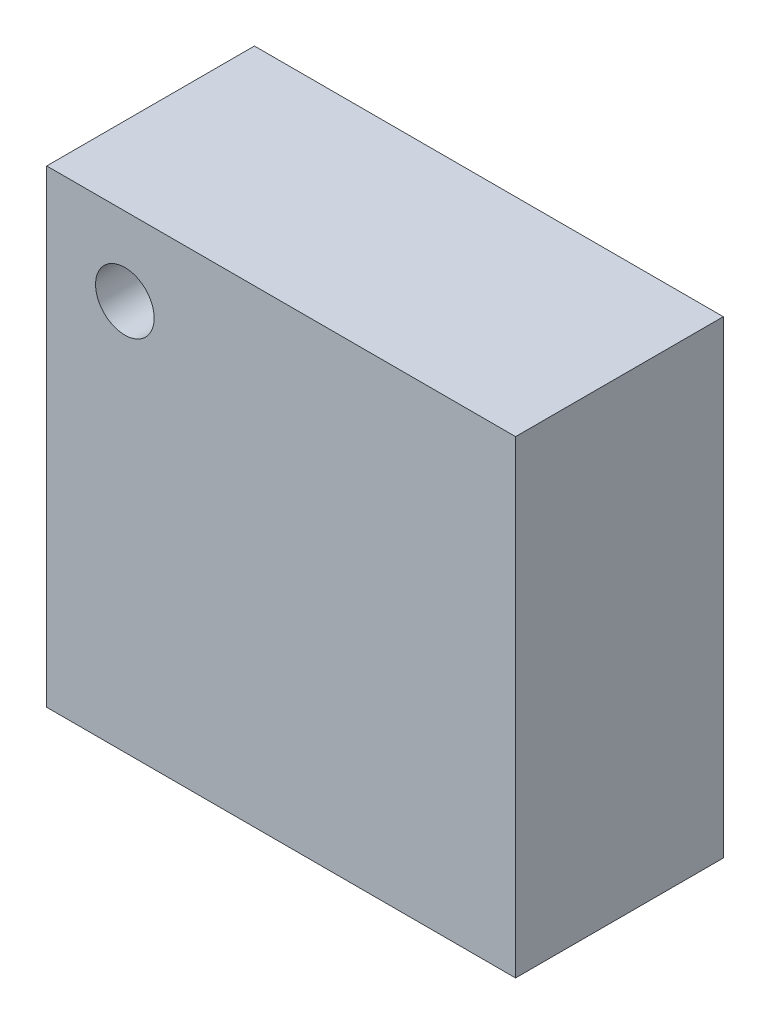
ISO-10303-21;
HEADER;
FILE_DESCRIPTION(('STEP AP214'),'2;1');
FILE_NAME('part.step','',(''),(''),'','','');
FILE_SCHEMA(('AUTOMOTIVE_DESIGN { 1 0 10303 214 1 1 1 1 }'));
ENDSEC;
DATA;
#1=APPLICATION_CONTEXT('core data for automotive mechanical design processes');
#2=APPLICATION_PROTOCOL_DEFINITION('international standard','automotive_design',2000,#1);
#3=PRODUCT_CONTEXT('',#1,'mechanical');
#4=PRODUCT('Part','Part','',(#3));
#5=PRODUCT_RELATED_PRODUCT_CATEGORY('part','',(#4));
#6=PRODUCT_DEFINITION_FORMATION('','',#4);
#7=PRODUCT_DEFINITION_CONTEXT('part definition',#1,'design');
#8=PRODUCT_DEFINITION('design','',#6,#7);
#9=PRODUCT_DEFINITION_SHAPE('','',#8);
#10=(LENGTH_UNIT() NAMED_UNIT(*) SI_UNIT(.MILLI.,.METRE.));
#11=(NAMED_UNIT(*) PLANE_ANGLE_UNIT() SI_UNIT($,.RADIAN.));
#12=(NAMED_UNIT(*) SI_UNIT($,.STERADIAN.) SOLID_ANGLE_UNIT());
#13=UNCERTAINTY_MEASURE_WITH_UNIT(LENGTH_MEASURE(1.E-05),#10,'distance_accuracy_value','');
#14=(GEOMETRIC_REPRESENTATION_CONTEXT(3) GLOBAL_UNCERTAINTY_ASSIGNED_CONTEXT((#13)) GLOBAL_UNIT_ASSIGNED_CONTEXT((#10,
#11,#12)) REPRESENTATION_CONTEXT('',''));
#15=CARTESIAN_POINT('',(0.,0.,0.));
#16=DIRECTION('',(0.,0.,1.));
#17=DIRECTION('',(1.,0.,0.));
#18=AXIS2_PLACEMENT_3D('',#15,#16,#17);
#19=CARTESIAN_POINT('',(0.131666666667,0.658333333333,0.45));
#20=DIRECTION('',(0.,0.,1.));
#21=DIRECTION('',(1.,0.,0.));
#22=AXIS2_PLACEMENT_3D('',#19,#20,#21);
#23=PLANE('',#22);
#24=CARTESIAN_POINT('',(0.131666666667,0.658333333333,0.45));
#25=DIRECTION('',(0.,0.,1.));
#26=DIRECTION('',(1.,0.,0.));
#27=AXIS2_PLACEMENT_3D('',#24,#25,#26);
#28=CIRCLE('',#27,0.049375);
#29=CARTESIAN_POINT('',(0.082291666667,0.658333333333,0.45));
#30=VERTEX_POINT('',#29);
#31=EDGE_CURVE('E27',#30,#30,#28,.T.);
#32=ORIENTED_EDGE('',*,*,#31,.T.);
#33=EDGE_LOOP('',(#32));
#34=FACE_BOUND('',#33,.T.);
#35=ADVANCED_FACE('F16',(#34),#23,.T.);
#36=CARTESIAN_POINT('',(0.131666666667,0.658333333333,0.45));
#37=DIRECTION('',(0.,0.,1.));
#38=DIRECTION('',(1.,0.,0.));
#39=AXIS2_PLACEMENT_3D('',#36,#37,#38);
#40=CYLINDRICAL_SURFACE('',#39,0.049375);
#41=ORIENTED_EDGE('',*,*,#31,.F.);
#42=DIRECTION('',(0.,0.,1.));
#43=VECTOR('',#42,1.);
#44=CARTESIAN_POINT('',(0.082291666667,0.658333333333,0.45));
#45=LINE('',#44,#43);
#46=CARTESIAN_POINT('',(0.082291666667,0.658333333333,0.55));
#47=VERTEX_POINT('',#46);
#48=EDGE_CURVE('E11',#30,#47,#45,.T.);
#49=ORIENTED_EDGE('',*,*,#48,.T.);
#50=CARTESIAN_POINT('',(0.131666666667,0.658333333333,0.55));
#51=DIRECTION('',(0.,0.,1.));
#52=DIRECTION('',(1.,0.,0.));
#53=AXIS2_PLACEMENT_3D('',#50,#51,#52);
#54=CIRCLE('',#53,0.049375);
#55=EDGE_CURVE('E97',#47,#47,#54,.T.);
#56=ORIENTED_EDGE('',*,*,#55,.T.);
#57=ORIENTED_EDGE('',*,*,#48,.F.);
#58=EDGE_LOOP('',(#41,#49,#56,#57));
#59=FACE_BOUND('',#58,.T.);
#60=ADVANCED_FACE('F149',(#59),#40,.F.);
#61=CARTESIAN_POINT('',(0.79,0.,0.2));
#62=DIRECTION('',(1.,0.,0.));
#63=DIRECTION('',(0.,1.,0.));
#64=AXIS2_PLACEMENT_3D('',#61,#62,#63);
#65=PLANE('',#64);
#66=DIRECTION('',(0.,0.,1.));
#67=VECTOR('',#66,1.);
#68=CARTESIAN_POINT('',(0.79,0.,0.2));
#69=LINE('',#68,#67);
#70=CARTESIAN_POINT('',(0.79,0.,0.2));
#71=VERTEX_POINT('',#70);
#72=CARTESIAN_POINT('',(0.79,0.,0.55));
#73=VERTEX_POINT('',#72);
#74=EDGE_CURVE('E127',#71,#73,#69,.T.);
#75=ORIENTED_EDGE('',*,*,#74,.F.);
#76=DIRECTION('',(0.,1.,0.));
#77=VECTOR('',#76,1.);
#78=CARTESIAN_POINT('',(0.79,0.,0.2));
#79=LINE('',#78,#77);
#80=CARTESIAN_POINT('',(0.79,0.79,0.2));
#81=VERTEX_POINT('',#80);
#82=EDGE_CURVE('E119',#71,#81,#79,.T.);
#83=ORIENTED_EDGE('',*,*,#82,.T.);
#84=DIRECTION('',(0.,0.,1.));
#85=VECTOR('',#84,1.);
#86=CARTESIAN_POINT('',(0.79,0.79,0.2));
#87=LINE('',#86,#85);
#88=CARTESIAN_POINT('',(0.79,0.79,0.55));
#89=VERTEX_POINT('',#88);
#90=EDGE_CURVE('E94',#81,#89,#87,.T.);
#91=ORIENTED_EDGE('',*,*,#90,.T.);
#92=DIRECTION('',(0.,1.,0.));
#93=VECTOR('',#92,1.);
#94=CARTESIAN_POINT('',(0.79,0.,0.55));
#95=LINE('',#94,#93);
#96=EDGE_CURVE('E125',#73,#89,#95,.T.);
#97=ORIENTED_EDGE('',*,*,#96,.F.);
#98=EDGE_LOOP('',(#75,#83,#91,#97));
#99=FACE_BOUND('',#98,.T.);
#100=ADVANCED_FACE('F133',(#99),#65,.T.);
#101=CARTESIAN_POINT('',(0.,0.,0.2));
#102=DIRECTION('',(0.,0.,1.));
#103=DIRECTION('',(1.,0.,0.));
#104=AXIS2_PLACEMENT_3D('',#101,#102,#103);
#105=PLANE('',#104);
#106=DIRECTION('',(0.,1.,0.));
#107=VECTOR('',#106,1.);
#108=CARTESIAN_POINT('',(0.,0.,0.2));
#109=LINE('',#108,#107);
#110=CARTESIAN_POINT('',(0.,0.,0.2));
#111=VERTEX_POINT('',#110);
#112=CARTESIAN_POINT('',(0.,0.79,0.2));
#113=VERTEX_POINT('',#112);
#114=EDGE_CURVE('E99',#111,#113,#109,.T.);
#115=ORIENTED_EDGE('',*,*,#114,.T.);
#116=DIRECTION('',(1.,0.,0.));
#117=VECTOR('',#116,1.);
#118=CARTESIAN_POINT('',(0.,0.79,0.2));
#119=LINE('',#118,#117);
#120=EDGE_CURVE('E20',#113,#81,#119,.T.);
#121=ORIENTED_EDGE('',*,*,#120,.T.);
#122=ORIENTED_EDGE('',*,*,#82,.F.);
#123=DIRECTION('',(1.,0.,0.));
#124=VECTOR('',#123,1.);
#125=CARTESIAN_POINT('',(0.,0.,0.2));
#126=LINE('',#125,#124);
#127=EDGE_CURVE('E102',#111,#71,#126,.T.);
#128=ORIENTED_EDGE('',*,*,#127,.F.);
#129=EDGE_LOOP('',(#115,#121,#122,#128));
#130=FACE_BOUND('',#129,.T.);
#131=ADVANCED_FACE('F100',(#130),#105,.F.);
#132=CARTESIAN_POINT('',(0.,0.79,0.2));
#133=DIRECTION('',(0.,1.,0.));
#134=DIRECTION('',(1.,0.,0.));
#135=AXIS2_PLACEMENT_3D('',#132,#133,#134);
#136=PLANE('',#135);
#137=ORIENTED_EDGE('',*,*,#120,.F.);
#138=DIRECTION('',(0.,0.,1.));
#139=VECTOR('',#138,1.);
#140=CARTESIAN_POINT('',(0.,0.79,0.2));
#141=LINE('',#140,#139);
#142=CARTESIAN_POINT('',(0.,0.79,0.55));
#143=VERTEX_POINT('',#142);
#144=EDGE_CURVE('E92',#113,#143,#141,.T.);
#145=ORIENTED_EDGE('',*,*,#144,.T.);
#146=DIRECTION('',(1.,0.,0.));
#147=VECTOR('',#146,1.);
#148=CARTESIAN_POINT('',(0.,0.79,0.55));
#149=LINE('',#148,#147);
#150=EDGE_CURVE('E81',#143,#89,#149,.T.);
#151=ORIENTED_EDGE('',*,*,#150,.T.);
#152=ORIENTED_EDGE('',*,*,#90,.F.);
#153=EDGE_LOOP('',(#137,#145,#151,#152));
#154=FACE_BOUND('',#153,.T.);
#155=ADVANCED_FACE('F90',(#154),#136,.T.);
#156=CARTESIAN_POINT('',(0.,0.,0.55));
#157=DIRECTION('',(0.,0.,1.));
#158=DIRECTION('',(1.,0.,0.));
#159=AXIS2_PLACEMENT_3D('',#156,#157,#158);
#160=PLANE('',#159);
#161=ORIENTED_EDGE('',*,*,#55,.F.);
#162=EDGE_LOOP('',(#161));
#163=FACE_BOUND('',#162,.T.);
#164=DIRECTION('',(0.,1.,0.));
#165=VECTOR('',#164,1.);
#166=CARTESIAN_POINT('',(0.,0.,0.55));
#167=LINE('',#166,#165);
#168=CARTESIAN_POINT('',(0.,0.,0.55));
#169=VERTEX_POINT('',#168);
#170=EDGE_CURVE('E108',#169,#143,#167,.T.);
#171=ORIENTED_EDGE('',*,*,#170,.F.);
#172=DIRECTION('',(1.,0.,0.));
#173=VECTOR('',#172,1.);
#174=CARTESIAN_POINT('',(0.,0.,0.55));
#175=LINE('',#174,#173);
#176=EDGE_CURVE('E73',#169,#73,#175,.T.);
#177=ORIENTED_EDGE('',*,*,#176,.T.);
#178=ORIENTED_EDGE('',*,*,#96,.T.);
#179=ORIENTED_EDGE('',*,*,#150,.F.);
#180=EDGE_LOOP('',(#171,#177,#178,#179));
#181=FACE_BOUND('',#180,.T.);
#182=ADVANCED_FACE('F18',(#163,#181),#160,.T.);
#183=CARTESIAN_POINT('',(0.,0.,0.2));
#184=DIRECTION('',(0.,1.,0.));
#185=DIRECTION('',(1.,0.,0.));
#186=AXIS2_PLACEMENT_3D('',#183,#184,#185);
#187=PLANE('',#186);
#188=ORIENTED_EDGE('',*,*,#127,.T.);
#189=ORIENTED_EDGE('',*,*,#74,.T.);
#190=ORIENTED_EDGE('',*,*,#176,.F.);
#191=DIRECTION('',(0.,0.,1.));
#192=VECTOR('',#191,1.);
#193=CARTESIAN_POINT('',(0.,0.,0.2));
#194=LINE('',#193,#192);
#195=EDGE_CURVE('E115',#111,#169,#194,.T.);
#196=ORIENTED_EDGE('',*,*,#195,.F.);
#197=EDGE_LOOP('',(#188,#189,#190,#196));
#198=FACE_BOUND('',#197,.T.);
#199=ADVANCED_FACE('F153',(#198),#187,.F.);
#200=CARTESIAN_POINT('',(0.,0.,0.2));
#201=DIRECTION('',(1.,0.,0.));
#202=DIRECTION('',(0.,1.,0.));
#203=AXIS2_PLACEMENT_3D('',#200,#201,#202);
#204=PLANE('',#203);
#205=ORIENTED_EDGE('',*,*,#195,.T.);
#206=ORIENTED_EDGE('',*,*,#170,.T.);
#207=ORIENTED_EDGE('',*,*,#144,.F.);
#208=ORIENTED_EDGE('',*,*,#114,.F.);
#209=EDGE_LOOP('',(#205,#206,#207,#208));
#210=FACE_BOUND('',#209,.T.);
#211=ADVANCED_FACE('F107',(#210),#204,.F.);
#212=CLOSED_SHELL('',(#35,#60,#100,#131,#155,#182,#199,#211));
#213=MANIFOLD_SOLID_BREP('B1',#212);
#214=ADVANCED_BREP_SHAPE_REPRESENTATION('',(#18,#213),#14);
#215=SHAPE_DEFINITION_REPRESENTATION(#9,#214);
ENDSEC;
END-ISO-10303-21;
